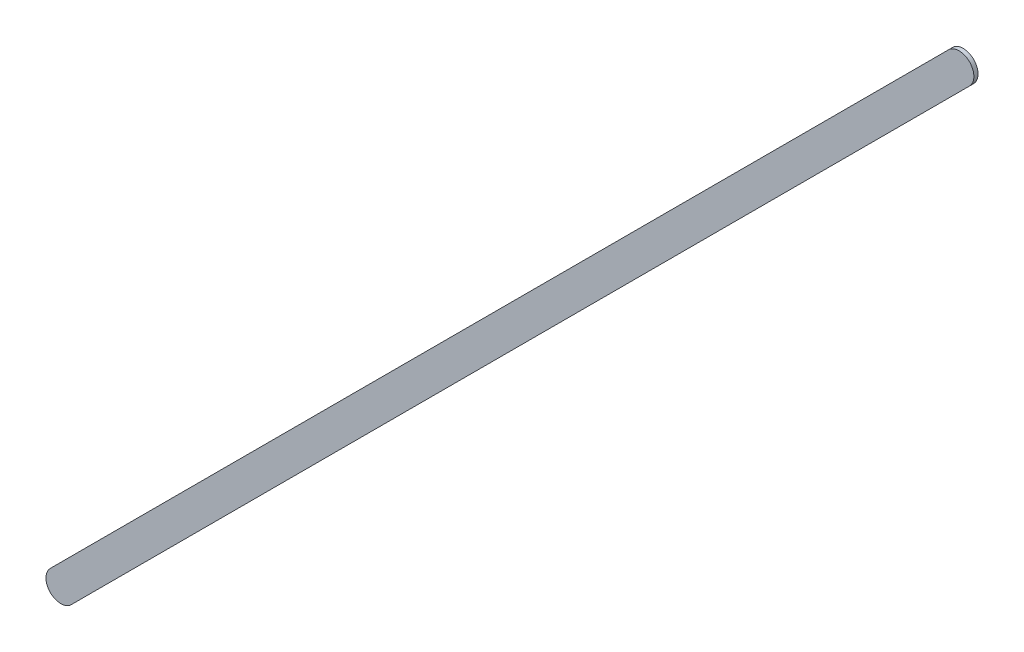
ISO-10303-21;
HEADER;
FILE_DESCRIPTION(('STEP AP214'),'2;1');
FILE_NAME('part.step','',(''),(''),'','','');
FILE_SCHEMA(('AUTOMOTIVE_DESIGN { 1 0 10303 214 1 1 1 1 }'));
ENDSEC;
DATA;
#1=APPLICATION_CONTEXT('core data for automotive mechanical design processes');
#2=APPLICATION_PROTOCOL_DEFINITION('international standard','automotive_design',2000,#1);
#3=PRODUCT_CONTEXT('',#1,'mechanical');
#4=PRODUCT('Part','Part','',(#3));
#5=PRODUCT_RELATED_PRODUCT_CATEGORY('part','',(#4));
#6=PRODUCT_DEFINITION_FORMATION('','',#4);
#7=PRODUCT_DEFINITION_CONTEXT('part definition',#1,'design');
#8=PRODUCT_DEFINITION('design','',#6,#7);
#9=PRODUCT_DEFINITION_SHAPE('','',#8);
#10=(LENGTH_UNIT() NAMED_UNIT(*) SI_UNIT(.MILLI.,.METRE.));
#11=(NAMED_UNIT(*) PLANE_ANGLE_UNIT() SI_UNIT($,.RADIAN.));
#12=(NAMED_UNIT(*) SI_UNIT($,.STERADIAN.) SOLID_ANGLE_UNIT());
#13=UNCERTAINTY_MEASURE_WITH_UNIT(LENGTH_MEASURE(1.E-05),#10,'distance_accuracy_value','');
#14=(GEOMETRIC_REPRESENTATION_CONTEXT(3) GLOBAL_UNCERTAINTY_ASSIGNED_CONTEXT((#13)) GLOBAL_UNIT_ASSIGNED_CONTEXT((#10,
#11,#12)) REPRESENTATION_CONTEXT('',''));
#15=CARTESIAN_POINT('',(0.,0.,0.));
#16=DIRECTION('',(0.,0.,1.));
#17=DIRECTION('',(1.,0.,0.));
#18=AXIS2_PLACEMENT_3D('',#15,#16,#17);
#19=CARTESIAN_POINT('',(78.606777,97.19717162,0.));
#20=DIRECTION('',(-0.707106781186548,0.707106781186548,0.));
#21=DIRECTION('',(0.707106781186548,0.707106781186548,0.));
#22=AXIS2_PLACEMENT_3D('',#19,#20,#21);
#23=PLANE('',#22);
#24=DIRECTION('',(0.707106781186548,0.707106781186548,0.));
#25=VECTOR('',#24,1.);
#26=CARTESIAN_POINT('',(78.606777,97.19717162,0.03556));
#27=LINE('',#26,#25);
#28=CARTESIAN_POINT('',(78.606777,97.19717162,0.03556));
#29=VERTEX_POINT('',#28);
#30=CARTESIAN_POINT('',(86.3067743,104.89716892,0.03556));
#31=VERTEX_POINT('',#30);
#32=EDGE_CURVE('E11',#29,#31,#27,.T.);
#33=ORIENTED_EDGE('',*,*,#32,.F.);
#34=DIRECTION('',(0.,0.,1.));
#35=VECTOR('',#34,1.);
#36=CARTESIAN_POINT('',(78.606777,97.19717162,0.));
#37=LINE('',#36,#35);
#38=CARTESIAN_POINT('',(78.606777,97.19717162,0.));
#39=VERTEX_POINT('',#38);
#40=EDGE_CURVE('E24',#39,#29,#37,.T.);
#41=ORIENTED_EDGE('',*,*,#40,.F.);
#42=DIRECTION('',(0.707106781186548,0.707106781186548,0.));
#43=VECTOR('',#42,1.);
#44=CARTESIAN_POINT('',(78.606777,97.19717162,0.));
#45=LINE('',#44,#43);
#46=CARTESIAN_POINT('',(86.3067743,104.89716892,0.));
#47=VERTEX_POINT('',#46);
#48=EDGE_CURVE('E75',#39,#47,#45,.T.);
#49=ORIENTED_EDGE('',*,*,#48,.T.);
#50=DIRECTION('',(0.,0.,1.));
#51=VECTOR('',#50,1.);
#52=CARTESIAN_POINT('',(86.3067743,104.89716892,0.));
#53=LINE('',#52,#51);
#54=EDGE_CURVE('E37',#47,#31,#53,.T.);
#55=ORIENTED_EDGE('',*,*,#54,.T.);
#56=EDGE_LOOP('',(#33,#41,#49,#55));
#57=FACE_BOUND('',#56,.T.);
#58=ADVANCED_FACE('F17',(#57),#23,.F.);
#59=CARTESIAN_POINT('',(86.21697133,104.98697189,0.));
#60=DIRECTION('',(0.,0.,-1.));
#61=DIRECTION('',(0.707106781186492,-0.707106781186604,0.));
#62=AXIS2_PLACEMENT_3D('',#59,#60,#61);
#63=CYLINDRICAL_SURFACE('',#62,0.127000578115389);
#64=CARTESIAN_POINT('',(86.21697133,104.98697189,0.03556));
#65=DIRECTION('',(0.,0.,1.));
#66=DIRECTION('',(0.707106781186492,-0.707106781186604,0.));
#67=AXIS2_PLACEMENT_3D('',#64,#65,#66);
#68=CIRCLE('',#67,0.127000578115389);
#69=CARTESIAN_POINT('',(86.12716836,105.07677486,0.03556));
#70=VERTEX_POINT('',#69);
#71=EDGE_CURVE('E83',#31,#70,#68,.T.);
#72=ORIENTED_EDGE('',*,*,#71,.F.);
#73=ORIENTED_EDGE('',*,*,#54,.F.);
#74=CARTESIAN_POINT('',(86.21697133,104.98697189,0.));
#75=DIRECTION('',(0.,0.,1.));
#76=DIRECTION('',(0.707106781186492,-0.707106781186604,0.));
#77=AXIS2_PLACEMENT_3D('',#74,#75,#76);
#78=CIRCLE('',#77,0.127000578115389);
#79=CARTESIAN_POINT('',(86.12716836,105.07677486,0.));
#80=VERTEX_POINT('',#79);
#81=EDGE_CURVE('E81',#47,#80,#78,.T.);
#82=ORIENTED_EDGE('',*,*,#81,.T.);
#83=DIRECTION('',(0.,0.,1.));
#84=VECTOR('',#83,1.);
#85=CARTESIAN_POINT('',(86.12716836,105.07677486,0.));
#86=LINE('',#85,#84);
#87=EDGE_CURVE('E67',#80,#70,#86,.T.);
#88=ORIENTED_EDGE('',*,*,#87,.T.);
#89=EDGE_LOOP('',(#72,#73,#82,#88));
#90=FACE_BOUND('',#89,.T.);
#91=ADVANCED_FACE('F89',(#90),#63,.T.);
#92=CARTESIAN_POINT('',(86.12716836,105.07677486,0.));
#93=DIRECTION('',(0.707106781186548,-0.707106781186548,0.));
#94=DIRECTION('',(-0.707106781186548,-0.707106781186548,0.));
#95=AXIS2_PLACEMENT_3D('',#92,#93,#94);
#96=PLANE('',#95);
#97=DIRECTION('',(-0.707106781186548,-0.707106781186548,0.));
#98=VECTOR('',#97,1.);
#99=CARTESIAN_POINT('',(86.12716836,105.07677486,0.03556));
#100=LINE('',#99,#98);
#101=CARTESIAN_POINT('',(78.42717106,97.37677756,0.03556));
#102=VERTEX_POINT('',#101);
#103=EDGE_CURVE('E71',#70,#102,#100,.T.);
#104=ORIENTED_EDGE('',*,*,#103,.F.);
#105=ORIENTED_EDGE('',*,*,#87,.F.);
#106=DIRECTION('',(-0.707106781186548,-0.707106781186548,0.));
#107=VECTOR('',#106,1.);
#108=CARTESIAN_POINT('',(86.12716836,105.07677486,0.));
#109=LINE('',#108,#107);
#110=CARTESIAN_POINT('',(78.42717106,97.37677756,0.));
#111=VERTEX_POINT('',#110);
#112=EDGE_CURVE('E63',#80,#111,#109,.T.);
#113=ORIENTED_EDGE('',*,*,#112,.T.);
#114=DIRECTION('',(0.,0.,1.));
#115=VECTOR('',#114,1.);
#116=CARTESIAN_POINT('',(78.42717106,97.37677756,0.));
#117=LINE('',#116,#115);
#118=EDGE_CURVE('E53',#111,#102,#117,.T.);
#119=ORIENTED_EDGE('',*,*,#118,.T.);
#120=EDGE_LOOP('',(#104,#105,#113,#119));
#121=FACE_BOUND('',#120,.T.);
#122=ADVANCED_FACE('F66',(#121),#96,.F.);
#123=CARTESIAN_POINT('',(78.51697403,97.28697459,0.));
#124=DIRECTION('',(0.,0.,-1.));
#125=DIRECTION('',(-0.707106781186604,0.707106781186492,0.));
#126=AXIS2_PLACEMENT_3D('',#123,#124,#125);
#127=CYLINDRICAL_SURFACE('',#126,0.127000578115392);
#128=CARTESIAN_POINT('',(78.51697403,97.28697459,0.03556));
#129=DIRECTION('',(0.,0.,1.));
#130=DIRECTION('',(-0.707106781186604,0.707106781186492,0.));
#131=AXIS2_PLACEMENT_3D('',#128,#129,#130);
#132=CIRCLE('',#131,0.127000578115392);
#133=EDGE_CURVE('E59',#102,#29,#132,.T.);
#134=ORIENTED_EDGE('',*,*,#133,.F.);
#135=ORIENTED_EDGE('',*,*,#118,.F.);
#136=CARTESIAN_POINT('',(78.51697403,97.28697459,0.));
#137=DIRECTION('',(0.,0.,1.));
#138=DIRECTION('',(-0.707106781186604,0.707106781186492,0.));
#139=AXIS2_PLACEMENT_3D('',#136,#137,#138);
#140=CIRCLE('',#139,0.127000578115392);
#141=EDGE_CURVE('E57',#111,#39,#140,.T.);
#142=ORIENTED_EDGE('',*,*,#141,.T.);
#143=ORIENTED_EDGE('',*,*,#40,.T.);
#144=EDGE_LOOP('',(#134,#135,#142,#143));
#145=FACE_BOUND('',#144,.T.);
#146=ADVANCED_FACE('F55',(#145),#127,.T.);
#147=CARTESIAN_POINT('',(78.606777,97.19717162,0.));
#148=DIRECTION('',(0.,0.,-1.));
#149=DIRECTION('',(-1.,0.,0.));
#150=AXIS2_PLACEMENT_3D('',#147,#148,#149);
#151=PLANE('',#150);
#152=ORIENTED_EDGE('',*,*,#141,.F.);
#153=ORIENTED_EDGE('',*,*,#112,.F.);
#154=ORIENTED_EDGE('',*,*,#81,.F.);
#155=ORIENTED_EDGE('',*,*,#48,.F.);
#156=EDGE_LOOP('',(#152,#153,#154,#155));
#157=FACE_BOUND('',#156,.T.);
#158=ADVANCED_FACE('F74',(#157),#151,.T.);
#159=CARTESIAN_POINT('',(78.606777,97.19717162,0.03556));
#160=DIRECTION('',(0.,0.,-1.));
#161=DIRECTION('',(-1.,0.,0.));
#162=AXIS2_PLACEMENT_3D('',#159,#160,#161);
#163=PLANE('',#162);
#164=ORIENTED_EDGE('',*,*,#32,.T.);
#165=ORIENTED_EDGE('',*,*,#71,.T.);
#166=ORIENTED_EDGE('',*,*,#103,.T.);
#167=ORIENTED_EDGE('',*,*,#133,.T.);
#168=EDGE_LOOP('',(#164,#165,#166,#167));
#169=FACE_BOUND('',#168,.T.);
#170=ADVANCED_FACE('F91',(#169),#163,.F.);
#171=CLOSED_SHELL('',(#58,#91,#122,#146,#158,#170));
#172=MANIFOLD_SOLID_BREP('B1',#171);
#173=ADVANCED_BREP_SHAPE_REPRESENTATION('',(#18,#172),#14);
#174=SHAPE_DEFINITION_REPRESENTATION(#9,#173);
ENDSEC;
END-ISO-10303-21;
